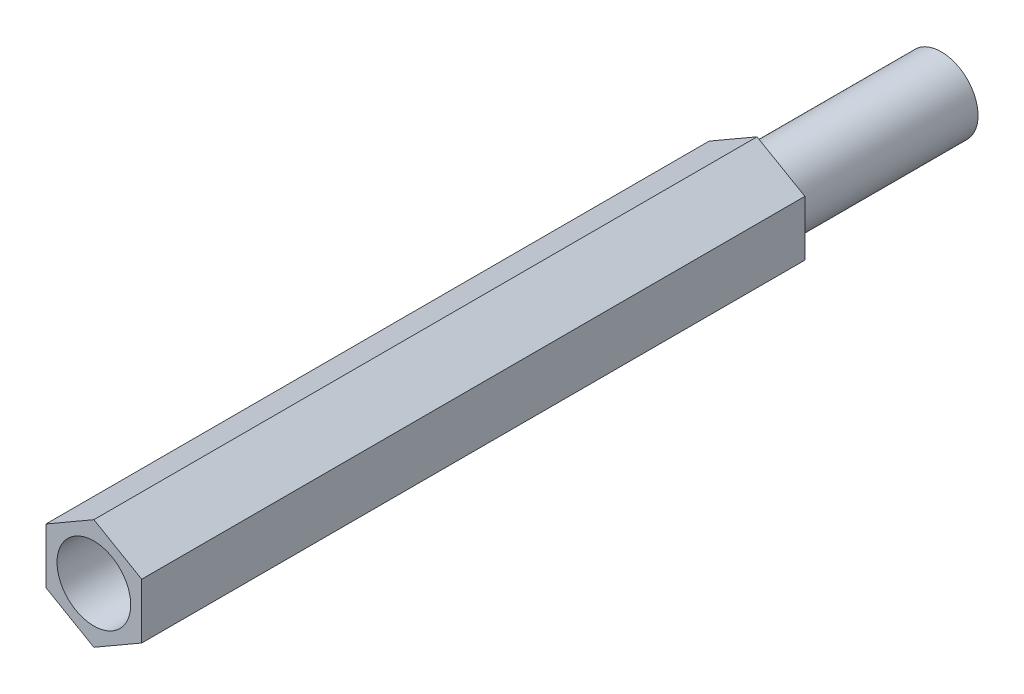
ISO-10303-21;
HEADER;
FILE_DESCRIPTION(('STEP AP214'),'2;1');
FILE_NAME('part.step','',(''),(''),'','','');
FILE_SCHEMA(('AUTOMOTIVE_DESIGN { 1 0 10303 214 1 1 1 1 }'));
ENDSEC;
DATA;
#1=APPLICATION_CONTEXT('core data for automotive mechanical design processes');
#2=APPLICATION_PROTOCOL_DEFINITION('international standard','automotive_design',2000,#1);
#3=PRODUCT_CONTEXT('',#1,'mechanical');
#4=PRODUCT('Part','Part','',(#3));
#5=PRODUCT_RELATED_PRODUCT_CATEGORY('part','',(#4));
#6=PRODUCT_DEFINITION_FORMATION('','',#4);
#7=PRODUCT_DEFINITION_CONTEXT('part definition',#1,'design');
#8=PRODUCT_DEFINITION('design','',#6,#7);
#9=PRODUCT_DEFINITION_SHAPE('','',#8);
#10=(LENGTH_UNIT() NAMED_UNIT(*) SI_UNIT(.MILLI.,.METRE.));
#11=(NAMED_UNIT(*) PLANE_ANGLE_UNIT() SI_UNIT($,.RADIAN.));
#12=(NAMED_UNIT(*) SI_UNIT($,.STERADIAN.) SOLID_ANGLE_UNIT());
#13=UNCERTAINTY_MEASURE_WITH_UNIT(LENGTH_MEASURE(1.E-05),#10,'distance_accuracy_value','');
#14=(GEOMETRIC_REPRESENTATION_CONTEXT(3) GLOBAL_UNCERTAINTY_ASSIGNED_CONTEXT((#13)) GLOBAL_UNIT_ASSIGNED_CONTEXT((#10,
#11,#12)) REPRESENTATION_CONTEXT('',''));
#15=CARTESIAN_POINT('',(0.,0.,0.));
#16=DIRECTION('',(0.,0.,1.));
#17=DIRECTION('',(1.,0.,0.));
#18=AXIS2_PLACEMENT_3D('',#15,#16,#17);
#19=CARTESIAN_POINT('',(2.59807621135331,0.,-36.));
#20=DIRECTION('',(1.,0.,0.));
#21=DIRECTION('',(0.,1.,0.));
#22=AXIS2_PLACEMENT_3D('',#19,#20,#21);
#23=PLANE('',#22);
#24=DIRECTION('',(0.,1.,0.));
#25=VECTOR('',#24,1.);
#26=CARTESIAN_POINT('',(2.59807621135331,0.,0.));
#27=LINE('',#26,#25);
#28=CARTESIAN_POINT('',(2.59807621135332,-1.5,0.));
#29=VERTEX_POINT('',#28);
#30=CARTESIAN_POINT('',(2.59807621135331,1.5,0.));
#31=VERTEX_POINT('',#30);
#32=EDGE_CURVE('E123',#29,#31,#27,.T.);
#33=ORIENTED_EDGE('',*,*,#32,.F.);
#34=DIRECTION('',(0.,0.,1.));
#35=VECTOR('',#34,1.);
#36=CARTESIAN_POINT('',(2.59807621135332,-1.5,-36.));
#37=LINE('',#36,#35);
#38=CARTESIAN_POINT('',(2.59807621135332,-1.5,-36.));
#39=VERTEX_POINT('',#38);
#40=EDGE_CURVE('E45',#39,#29,#37,.T.);
#41=ORIENTED_EDGE('',*,*,#40,.F.);
#42=DIRECTION('',(0.,1.,0.));
#43=VECTOR('',#42,1.);
#44=CARTESIAN_POINT('',(2.59807621135331,0.,-36.));
#45=LINE('',#44,#43);
#46=CARTESIAN_POINT('',(2.59807621135331,1.5,-36.));
#47=VERTEX_POINT('',#46);
#48=EDGE_CURVE('E139',#39,#47,#45,.T.);
#49=ORIENTED_EDGE('',*,*,#48,.T.);
#50=DIRECTION('',(0.,0.,1.));
#51=VECTOR('',#50,1.);
#52=CARTESIAN_POINT('',(2.59807621135331,1.5,-36.));
#53=LINE('',#52,#51);
#54=EDGE_CURVE('E39',#47,#31,#53,.T.);
#55=ORIENTED_EDGE('',*,*,#54,.T.);
#56=EDGE_LOOP('',(#33,#41,#49,#55));
#57=FACE_BOUND('',#56,.T.);
#58=ADVANCED_FACE('F36',(#57),#23,.T.);
#59=CARTESIAN_POINT('',(1.29903810567666,-2.25,-36.));
#60=DIRECTION('',(0.5,-0.866025403784439,0.));
#61=DIRECTION('',(0.866025403784439,0.5,0.));
#62=AXIS2_PLACEMENT_3D('',#59,#60,#61);
#63=PLANE('',#62);
#64=DIRECTION('',(0.866025403784439,0.5,0.));
#65=VECTOR('',#64,1.);
#66=CARTESIAN_POINT('',(1.29903810567666,-2.25,0.));
#67=LINE('',#66,#65);
#68=CARTESIAN_POINT('',(0.,-3.,0.));
#69=VERTEX_POINT('',#68);
#70=EDGE_CURVE('E136',#69,#29,#67,.T.);
#71=ORIENTED_EDGE('',*,*,#70,.F.);
#72=DIRECTION('',(0.,0.,1.));
#73=VECTOR('',#72,1.);
#74=CARTESIAN_POINT('',(0.,-3.,-36.));
#75=LINE('',#74,#73);
#76=CARTESIAN_POINT('',(0.,-3.,-36.));
#77=VERTEX_POINT('',#76);
#78=EDGE_CURVE('E76',#77,#69,#75,.T.);
#79=ORIENTED_EDGE('',*,*,#78,.F.);
#80=DIRECTION('',(0.866025403784439,0.5,0.));
#81=VECTOR('',#80,1.);
#82=CARTESIAN_POINT('',(1.29903810567666,-2.25,-36.));
#83=LINE('',#82,#81);
#84=EDGE_CURVE('E113',#77,#39,#83,.T.);
#85=ORIENTED_EDGE('',*,*,#84,.T.);
#86=ORIENTED_EDGE('',*,*,#40,.T.);
#87=EDGE_LOOP('',(#71,#79,#85,#86));
#88=FACE_BOUND('',#87,.T.);
#89=ADVANCED_FACE('F147',(#88),#63,.T.);
#90=CARTESIAN_POINT('',(-1.29903810567666,-2.25,-36.));
#91=DIRECTION('',(-0.5,-0.866025403784439,0.));
#92=DIRECTION('',(0.866025403784439,-0.5,0.));
#93=AXIS2_PLACEMENT_3D('',#90,#91,#92);
#94=PLANE('',#93);
#95=DIRECTION('',(0.866025403784439,-0.5,0.));
#96=VECTOR('',#95,1.);
#97=CARTESIAN_POINT('',(-1.29903810567666,-2.25,0.));
#98=LINE('',#97,#96);
#99=CARTESIAN_POINT('',(-2.59807621135331,-1.5,0.));
#100=VERTEX_POINT('',#99);
#101=EDGE_CURVE('E100',#100,#69,#98,.T.);
#102=ORIENTED_EDGE('',*,*,#101,.F.);
#103=DIRECTION('',(0.,0.,1.));
#104=VECTOR('',#103,1.);
#105=CARTESIAN_POINT('',(-2.59807621135331,-1.5,-36.));
#106=LINE('',#105,#104);
#107=CARTESIAN_POINT('',(-2.59807621135331,-1.5,-36.));
#108=VERTEX_POINT('',#107);
#109=EDGE_CURVE('E95',#108,#100,#106,.T.);
#110=ORIENTED_EDGE('',*,*,#109,.F.);
#111=DIRECTION('',(0.866025403784439,-0.5,0.));
#112=VECTOR('',#111,1.);
#113=CARTESIAN_POINT('',(-1.29903810567666,-2.25,-36.));
#114=LINE('',#113,#112);
#115=EDGE_CURVE('E98',#108,#77,#114,.T.);
#116=ORIENTED_EDGE('',*,*,#115,.T.);
#117=ORIENTED_EDGE('',*,*,#78,.T.);
#118=EDGE_LOOP('',(#102,#110,#116,#117));
#119=FACE_BOUND('',#118,.T.);
#120=ADVANCED_FACE('F97',(#119),#94,.T.);
#121=CARTESIAN_POINT('',(-2.59807621135332,0.,-36.));
#122=DIRECTION('',(-1.,0.,0.));
#123=DIRECTION('',(0.,-1.,0.));
#124=AXIS2_PLACEMENT_3D('',#121,#122,#123);
#125=PLANE('',#124);
#126=DIRECTION('',(0.,-1.,0.));
#127=VECTOR('',#126,1.);
#128=CARTESIAN_POINT('',(-2.59807621135332,0.,0.));
#129=LINE('',#128,#127);
#130=CARTESIAN_POINT('',(-2.59807621135332,1.5,0.));
#131=VERTEX_POINT('',#130);
#132=EDGE_CURVE('E133',#131,#100,#129,.T.);
#133=ORIENTED_EDGE('',*,*,#132,.F.);
#134=DIRECTION('',(0.,0.,1.));
#135=VECTOR('',#134,1.);
#136=CARTESIAN_POINT('',(-2.59807621135332,1.5,-36.));
#137=LINE('',#136,#135);
#138=CARTESIAN_POINT('',(-2.59807621135332,1.5,-36.));
#139=VERTEX_POINT('',#138);
#140=EDGE_CURVE('E105',#139,#131,#137,.T.);
#141=ORIENTED_EDGE('',*,*,#140,.F.);
#142=DIRECTION('',(0.,-1.,0.));
#143=VECTOR('',#142,1.);
#144=CARTESIAN_POINT('',(-2.59807621135332,0.,-36.));
#145=LINE('',#144,#143);
#146=EDGE_CURVE('E111',#139,#108,#145,.T.);
#147=ORIENTED_EDGE('',*,*,#146,.T.);
#148=ORIENTED_EDGE('',*,*,#109,.T.);
#149=EDGE_LOOP('',(#133,#141,#147,#148));
#150=FACE_BOUND('',#149,.T.);
#151=ADVANCED_FACE('F115',(#150),#125,.T.);
#152=CARTESIAN_POINT('',(-1.29903810567666,2.25,-36.));
#153=DIRECTION('',(-0.5,0.866025403784438,0.));
#154=DIRECTION('',(-0.866025403784439,-0.5,0.));
#155=AXIS2_PLACEMENT_3D('',#152,#153,#154);
#156=PLANE('',#155);
#157=DIRECTION('',(-0.866025403784439,-0.5,0.));
#158=VECTOR('',#157,1.);
#159=CARTESIAN_POINT('',(-1.29903810567666,2.25,0.));
#160=LINE('',#159,#158);
#161=CARTESIAN_POINT('',(0.,3.,0.));
#162=VERTEX_POINT('',#161);
#163=EDGE_CURVE('E130',#162,#131,#160,.T.);
#164=ORIENTED_EDGE('',*,*,#163,.F.);
#165=DIRECTION('',(0.,0.,1.));
#166=VECTOR('',#165,1.);
#167=CARTESIAN_POINT('',(0.,3.,-36.));
#168=LINE('',#167,#166);
#169=CARTESIAN_POINT('',(0.,3.,-36.));
#170=VERTEX_POINT('',#169);
#171=EDGE_CURVE('E142',#170,#162,#168,.T.);
#172=ORIENTED_EDGE('',*,*,#171,.F.);
#173=DIRECTION('',(-0.866025403784439,-0.5,0.));
#174=VECTOR('',#173,1.);
#175=CARTESIAN_POINT('',(-1.29903810567666,2.25,-36.));
#176=LINE('',#175,#174);
#177=EDGE_CURVE('E116',#170,#139,#176,.T.);
#178=ORIENTED_EDGE('',*,*,#177,.T.);
#179=ORIENTED_EDGE('',*,*,#140,.T.);
#180=EDGE_LOOP('',(#164,#172,#178,#179));
#181=FACE_BOUND('',#180,.T.);
#182=ADVANCED_FACE('F160',(#181),#156,.T.);
#183=CARTESIAN_POINT('',(1.29903810567666,2.25,-36.));
#184=DIRECTION('',(0.5,0.866025403784439,0.));
#185=DIRECTION('',(-0.866025403784439,0.5,0.));
#186=AXIS2_PLACEMENT_3D('',#183,#184,#185);
#187=PLANE('',#186);
#188=DIRECTION('',(-0.866025403784439,0.5,0.));
#189=VECTOR('',#188,1.);
#190=CARTESIAN_POINT('',(1.29903810567666,2.25,0.));
#191=LINE('',#190,#189);
#192=EDGE_CURVE('E126',#31,#162,#191,.T.);
#193=ORIENTED_EDGE('',*,*,#192,.F.);
#194=ORIENTED_EDGE('',*,*,#54,.F.);
#195=DIRECTION('',(-0.866025403784439,0.5,0.));
#196=VECTOR('',#195,1.);
#197=CARTESIAN_POINT('',(1.29903810567666,2.25,-36.));
#198=LINE('',#197,#196);
#199=EDGE_CURVE('E118',#47,#170,#198,.T.);
#200=ORIENTED_EDGE('',*,*,#199,.T.);
#201=ORIENTED_EDGE('',*,*,#171,.T.);
#202=EDGE_LOOP('',(#193,#194,#200,#201));
#203=FACE_BOUND('',#202,.T.);
#204=ADVANCED_FACE('F144',(#203),#187,.T.);
#205=CARTESIAN_POINT('',(0.,0.,-36.));
#206=DIRECTION('',(0.,0.,1.));
#207=DIRECTION('',(1.,0.,0.));
#208=AXIS2_PLACEMENT_3D('',#205,#206,#207);
#209=PLANE('',#208);
#210=CARTESIAN_POINT('',(0.,0.,-36.));
#211=DIRECTION('',(0.,0.,-1.));
#212=DIRECTION('',(-1.,0.,0.));
#213=AXIS2_PLACEMENT_3D('',#210,#211,#212);
#214=CIRCLE('',#213,2.);
#215=CARTESIAN_POINT('',(-2.,0.,-36.));
#216=VERTEX_POINT('',#215);
#217=EDGE_CURVE('E11',#216,#216,#214,.T.);
#218=ORIENTED_EDGE('',*,*,#217,.F.);
#219=EDGE_LOOP('',(#218));
#220=FACE_BOUND('',#219,.T.);
#221=ORIENTED_EDGE('',*,*,#48,.F.);
#222=ORIENTED_EDGE('',*,*,#84,.F.);
#223=ORIENTED_EDGE('',*,*,#115,.F.);
#224=ORIENTED_EDGE('',*,*,#146,.F.);
#225=ORIENTED_EDGE('',*,*,#177,.F.);
#226=ORIENTED_EDGE('',*,*,#199,.F.);
#227=EDGE_LOOP('',(#221,#222,#223,#224,#225,#226));
#228=FACE_BOUND('',#227,.T.);
#229=ADVANCED_FACE('F109',(#220,#228),#209,.F.);
#230=CARTESIAN_POINT('',(0.,0.,0.));
#231=DIRECTION('',(0.,0.,1.));
#232=DIRECTION('',(1.,0.,0.));
#233=AXIS2_PLACEMENT_3D('',#230,#231,#232);
#234=PLANE('',#233);
#235=CARTESIAN_POINT('',(0.,0.,0.));
#236=DIRECTION('',(0.,0.,1.));
#237=DIRECTION('',(1.,0.,0.));
#238=AXIS2_PLACEMENT_3D('',#235,#236,#237);
#239=CIRCLE('',#238,2.);
#240=CARTESIAN_POINT('',(2.,0.,0.));
#241=VERTEX_POINT('',#240);
#242=EDGE_CURVE('E194',#241,#241,#239,.T.);
#243=ORIENTED_EDGE('',*,*,#242,.F.);
#244=EDGE_LOOP('',(#243));
#245=FACE_BOUND('',#244,.T.);
#246=ORIENTED_EDGE('',*,*,#32,.T.);
#247=ORIENTED_EDGE('',*,*,#192,.T.);
#248=ORIENTED_EDGE('',*,*,#163,.T.);
#249=ORIENTED_EDGE('',*,*,#132,.T.);
#250=ORIENTED_EDGE('',*,*,#101,.T.);
#251=ORIENTED_EDGE('',*,*,#70,.T.);
#252=EDGE_LOOP('',(#246,#247,#248,#249,#250,#251));
#253=FACE_BOUND('',#252,.T.);
#254=ADVANCED_FACE('F146',(#245,#253),#234,.T.);
#255=CARTESIAN_POINT('',(0.,0.,-29.));
#256=DIRECTION('',(0.,0.,1.));
#257=DIRECTION('',(1.,0.,0.));
#258=AXIS2_PLACEMENT_3D('',#255,#256,#257);
#259=CYLINDRICAL_SURFACE('',#258,2.);
#260=CARTESIAN_POINT('',(0.,0.,-29.));
#261=DIRECTION('',(0.,0.,1.));
#262=DIRECTION('',(1.,0.,0.));
#263=AXIS2_PLACEMENT_3D('',#260,#261,#262);
#264=CIRCLE('',#263,2.);
#265=CARTESIAN_POINT('',(2.,0.,-29.));
#266=VERTEX_POINT('',#265);
#267=EDGE_CURVE('E127',#266,#266,#264,.T.);
#268=ORIENTED_EDGE('',*,*,#267,.F.);
#269=EDGE_LOOP('',(#268));
#270=FACE_BOUND('',#269,.T.);
#271=ORIENTED_EDGE('',*,*,#242,.T.);
#272=EDGE_LOOP('',(#271));
#273=FACE_BOUND('',#272,.T.);
#274=ADVANCED_FACE('F171',(#270,#273),#259,.F.);
#275=CARTESIAN_POINT('',(0.,0.,-29.));
#276=DIRECTION('',(0.,0.,1.));
#277=DIRECTION('',(1.,0.,0.));
#278=AXIS2_PLACEMENT_3D('',#275,#276,#277);
#279=PLANE('',#278);
#280=ORIENTED_EDGE('',*,*,#267,.T.);
#281=EDGE_LOOP('',(#280));
#282=FACE_BOUND('',#281,.T.);
#283=ADVANCED_FACE('F177',(#282),#279,.T.);
#284=CARTESIAN_POINT('',(0.,0.,-46.));
#285=DIRECTION('',(0.,0.,1.));
#286=DIRECTION('',(1.,0.,0.));
#287=AXIS2_PLACEMENT_3D('',#284,#285,#286);
#288=CYLINDRICAL_SURFACE('',#287,2.);
#289=CARTESIAN_POINT('',(0.,0.,-46.));
#290=DIRECTION('',(0.,0.,-1.));
#291=DIRECTION('',(-1.,0.,0.));
#292=AXIS2_PLACEMENT_3D('',#289,#290,#291);
#293=CIRCLE('',#292,2.);
#294=CARTESIAN_POINT('',(-2.,0.,-46.));
#295=VERTEX_POINT('',#294);
#296=EDGE_CURVE('E193',#295,#295,#293,.T.);
#297=ORIENTED_EDGE('',*,*,#296,.F.);
#298=EDGE_LOOP('',(#297));
#299=FACE_BOUND('',#298,.T.);
#300=ORIENTED_EDGE('',*,*,#217,.T.);
#301=EDGE_LOOP('',(#300));
#302=FACE_BOUND('',#301,.T.);
#303=ADVANCED_FACE('F181',(#299,#302),#288,.T.);
#304=CARTESIAN_POINT('',(0.,0.,-46.));
#305=DIRECTION('',(0.,0.,-1.));
#306=DIRECTION('',(-1.,0.,0.));
#307=AXIS2_PLACEMENT_3D('',#304,#305,#306);
#308=PLANE('',#307);
#309=ORIENTED_EDGE('',*,*,#296,.T.);
#310=EDGE_LOOP('',(#309));
#311=FACE_BOUND('',#310,.T.);
#312=ADVANCED_FACE('F185',(#311),#308,.T.);
#313=CLOSED_SHELL('',(#58,#89,#120,#151,#182,#204,#229,#254,#274,#283,#303,#312));
#314=MANIFOLD_SOLID_BREP('B2',#313);
#315=ADVANCED_BREP_SHAPE_REPRESENTATION('',(#18,#314),#14);
#316=SHAPE_DEFINITION_REPRESENTATION(#9,#315);
ENDSEC;
END-ISO-10303-21;
